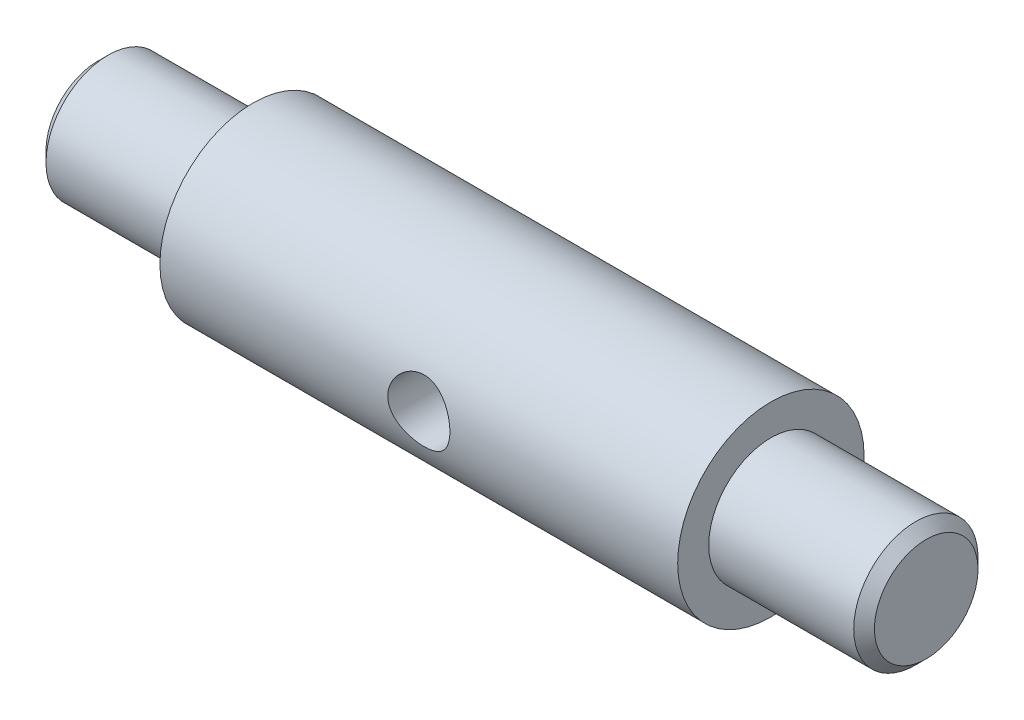
ISO-10303-21;
HEADER;
FILE_DESCRIPTION(('STEP AP214'),'2;1');
FILE_NAME('part.step','',(''),(''),'','','');
FILE_SCHEMA(('AUTOMOTIVE_DESIGN { 1 0 10303 214 1 1 1 1 }'));
ENDSEC;
DATA;
#1=APPLICATION_CONTEXT('core data for automotive mechanical design processes');
#2=APPLICATION_PROTOCOL_DEFINITION('international standard','automotive_design',2000,#1);
#3=PRODUCT_CONTEXT('',#1,'mechanical');
#4=PRODUCT('Part','Part','',(#3));
#5=PRODUCT_RELATED_PRODUCT_CATEGORY('part','',(#4));
#6=PRODUCT_DEFINITION_FORMATION('','',#4);
#7=PRODUCT_DEFINITION_CONTEXT('part definition',#1,'design');
#8=PRODUCT_DEFINITION('design','',#6,#7);
#9=PRODUCT_DEFINITION_SHAPE('','',#8);
#10=(LENGTH_UNIT() NAMED_UNIT(*) SI_UNIT(.MILLI.,.METRE.));
#11=(NAMED_UNIT(*) PLANE_ANGLE_UNIT() SI_UNIT($,.RADIAN.));
#12=(NAMED_UNIT(*) SI_UNIT($,.STERADIAN.) SOLID_ANGLE_UNIT());
#13=UNCERTAINTY_MEASURE_WITH_UNIT(LENGTH_MEASURE(1.E-05),#10,'distance_accuracy_value','');
#14=(GEOMETRIC_REPRESENTATION_CONTEXT(3) GLOBAL_UNCERTAINTY_ASSIGNED_CONTEXT((#13)) GLOBAL_UNIT_ASSIGNED_CONTEXT((#10,
#11,#12)) REPRESENTATION_CONTEXT('',''));
#15=CARTESIAN_POINT('',(0.,0.,0.));
#16=DIRECTION('',(0.,0.,1.));
#17=DIRECTION('',(1.,0.,0.));
#18=AXIS2_PLACEMENT_3D('',#15,#16,#17);
#19=CARTESIAN_POINT('',(40.,0.,-9.));
#20=DIRECTION('',(0.,0.,1.));
#21=DIRECTION('',(1.,0.,0.));
#22=AXIS2_PLACEMENT_3D('',#19,#20,#21);
#23=CYLINDRICAL_SURFACE('',#22,3.);
#24=CARTESIAN_POINT('',(43.,0.,9.));
#25=CARTESIAN_POINT('',(43.0000007611949,-0.16369008866017,9.00000045902832));
#26=CARTESIAN_POINT('',(42.9865592016184,-0.327375583615649,8.99549308522634));
#27=CARTESIAN_POINT('',(42.9333126735484,-0.649925282618916,8.97795630609842));
#28=CARTESIAN_POINT('',(42.8935049681532,-0.808788984356453,8.96492601606457));
#29=CARTESIAN_POINT('',(42.7890422698479,-1.11699836850533,8.93175923719328));
#30=CARTESIAN_POINT('',(42.7244288126222,-1.2663594776581,8.9116346319256));
#31=CARTESIAN_POINT('',(42.572376481485,-1.55212481041597,8.86633337152025));
#32=CARTESIAN_POINT('',(42.4849331049922,-1.68852647087612,8.84115572003333));
#33=CARTESIAN_POINT('',(42.2865225854237,-1.9492250250668,8.78742283329015));
#34=CARTESIAN_POINT('',(42.1749062972185,-2.07301110089493,8.75878669391354));
#35=CARTESIAN_POINT('',(41.9326985358803,-2.30049807810625,8.70180944349364));
#36=CARTESIAN_POINT('',(41.8021028952145,-2.40419455646839,8.67346839871647));
#37=CARTESIAN_POINT('',(41.5210446544106,-2.59147482668358,8.61939997431821));
#38=CARTESIAN_POINT('',(41.3701187808036,-2.67439457466309,8.59377117827064));
#39=CARTESIAN_POINT('',(41.0554717166244,-2.81345662163316,8.54925916255803));
#40=CARTESIAN_POINT('',(40.8917544485118,-2.8696070921603,8.53037388482237));
#41=CARTESIAN_POINT('',(40.5619803355099,-2.95162038452749,8.50233909808131));
#42=CARTESIAN_POINT('',(40.3961883745328,-2.97844034481531,8.49288287308833));
#43=CARTESIAN_POINT('',(40.0622087375324,-3.00402337000343,8.48386969888522));
#44=CARTESIAN_POINT('',(39.8940218178724,-3.00279510481416,8.4843096906819));
#45=CARTESIAN_POINT('',(39.5681901086679,-2.97305971111026,8.4947704502454));
#46=CARTESIAN_POINT('',(39.4104147912429,-2.94580173950099,8.50435247602598));
#47=CARTESIAN_POINT('',(39.1018197411795,-2.86681848854825,8.53129973173652));
#48=CARTESIAN_POINT('',(38.9510008436948,-2.81509027977562,8.54866589352322));
#49=CARTESIAN_POINT('',(38.6577617512256,-2.68781717418063,8.58953733393746));
#50=CARTESIAN_POINT('',(38.5155159235914,-2.61190214612179,8.61313697379352));
#51=CARTESIAN_POINT('',(38.2453872751608,-2.43866731890942,8.66377675727179));
#52=CARTESIAN_POINT('',(38.1175086191999,-2.34134133709202,8.6908178937139));
#53=CARTESIAN_POINT('',(37.8727252055177,-2.12204799804671,8.74701987503222));
#54=CARTESIAN_POINT('',(37.7567419164728,-1.99905945022894,8.77621768064528));
#55=CARTESIAN_POINT('',(37.5468062000098,-1.73501870991019,8.8322081516111));
#56=CARTESIAN_POINT('',(37.4528558855065,-1.59396478698244,8.85900058614202));
#57=CARTESIAN_POINT('',(37.2889110992948,-1.2958428391388,8.90751323813381));
#58=CARTESIAN_POINT('',(37.2191635259778,-1.13862982924901,8.92918050024118));
#59=CARTESIAN_POINT('',(37.1073904781329,-0.813807250093524,8.96461701433304));
#60=CARTESIAN_POINT('',(37.0653553737297,-0.646201314464864,8.97838900964638));
#61=CARTESIAN_POINT('',(37.0118330019329,-0.313151488587917,8.99602881214321));
#62=CARTESIAN_POINT('',(36.9991005724817,-0.147928799594543,9.00030005501184));
#63=CARTESIAN_POINT('',(37.0009980207954,0.182325209880709,8.99966708084482));
#64=CARTESIAN_POINT('',(37.0156232799396,0.347356557958949,8.99476441258087));
#65=CARTESIAN_POINT('',(37.0708357232079,0.667559598912765,8.97660074151313));
#66=CARTESIAN_POINT('',(37.1106586181485,0.822878420504528,8.96358596133577));
#67=CARTESIAN_POINT('',(37.2141803334002,1.12456787573872,8.9307554049021));
#68=CARTESIAN_POINT('',(37.2778821984034,1.27093736552582,8.91093876140025));
#69=CARTESIAN_POINT('',(37.4292112955224,1.55486488917982,8.86586793861869));
#70=CARTESIAN_POINT('',(37.5174237798495,1.69208987765144,8.84048444267358));
#71=CARTESIAN_POINT('',(37.7145824500404,1.95019449040676,8.78715761748787));
#72=CARTESIAN_POINT('',(37.8235349680953,2.07106910338673,8.75921350781482));
#73=CARTESIAN_POINT('',(38.0649362530198,2.2987575234189,8.70230543941334));
#74=CARTESIAN_POINT('',(38.1982276807806,2.40468290773731,8.67335283262283));
#75=CARTESIAN_POINT('',(38.4813147034327,2.59277256697072,8.61899919884126));
#76=CARTESIAN_POINT('',(38.6311104359022,2.67493664379304,8.59359820146007));
#77=CARTESIAN_POINT('',(38.9430190458697,2.81279079124909,8.5494717537415));
#78=CARTESIAN_POINT('',(39.1051062375063,2.86853439649506,8.53073282378936));
#79=CARTESIAN_POINT('',(39.4371359501324,2.95168400027807,8.50232496919348));
#80=CARTESIAN_POINT('',(39.607074896213,2.97910276486182,8.49265195870918));
#81=CARTESIAN_POINT('',(39.9405912881227,3.00382884743203,8.48393576622531));
#82=CARTESIAN_POINT('',(40.1040470208605,3.0026107719252,8.48437200772245));
#83=CARTESIAN_POINT('',(40.4282952247662,2.97372688034608,8.49453809471602));
#84=CARTESIAN_POINT('',(40.5890878538653,2.94606263837576,8.50426738708084));
#85=CARTESIAN_POINT('',(40.9004069890074,2.86611543938804,8.53153572914675));
#86=CARTESIAN_POINT('',(41.0510704750135,2.81431003804654,8.54892294067432));
#87=CARTESIAN_POINT('',(41.3416822208148,2.68793809727924,8.58949196455405));
#88=CARTESIAN_POINT('',(41.481628093564,2.61336650566142,8.61267506290179));
#89=CARTESIAN_POINT('',(41.7534510097687,2.43978207775029,8.66348487678139));
#90=CARTESIAN_POINT('',(41.8847095056952,2.33984472829374,8.69126134926411));
#91=CARTESIAN_POINT('',(42.1290694401526,2.11992864940694,8.74750068849758));
#92=CARTESIAN_POINT('',(42.2421657270642,1.99994425335444,8.77596374737117));
#93=CARTESIAN_POINT('',(42.4514332368675,1.73772467076207,8.83170091576632));
#94=CARTESIAN_POINT('',(42.546773043253,1.59480454049919,8.8588854540377));
#95=CARTESIAN_POINT('',(42.7119712865519,1.29407207221988,8.90777973517836));
#96=CARTESIAN_POINT('',(42.7818362377661,1.13626355439705,8.92949087723789));
#97=CARTESIAN_POINT('',(42.891164897466,0.81748094160293,8.96416545205625));
#98=CARTESIAN_POINT('',(42.9318473987901,0.656963273029229,8.97747637267567));
#99=CARTESIAN_POINT('',(42.9862608420314,0.330961248030743,8.99539221192665));
#100=CARTESIAN_POINT('',(42.9999992304896,0.16547827670624,8.99999953595715));
#101=CARTESIAN_POINT('',(43.,0.,9.));
#102=B_SPLINE_CURVE_WITH_KNOTS('',3,(#24,#25,#26,#27,#28,#29,#30,#31,#32,#33,#34,#35,#36,#37,
#38,#39,#40,#41,#42,#43,#44,#45,#46,#47,#48,#49,#50,#51,#52,#53,#54,#55,#56,#57,#58,#59,#60,#61,
#62,#63,#64,#65,#66,#67,#68,#69,#70,#71,#72,#73,#74,#75,#76,#77,#78,#79,#80,#81,#82,#83,#84,#85,
#86,#87,#88,#89,#90,#91,#92,#93,#94,#95,#96,#97,#98,#99,#100,#101),.UNSPECIFIED.,.T.,.F.,(4,2,2,
2,2,2,2,2,2,2,2,2,2,2,2,2,2,2,2,2,2,2,2,2,2,2,2,2,2,2,2,2,2,2,2,2,2,2,4),(0.,0.490461318078033,
0.980973555802562,1.47066801861082,1.9604591333973,2.46554052848268,2.97073299862591,
3.49045154470411,4.010011340785,4.51205777225521,5.01394901962457,5.49290479653841,
5.97191792566446,6.45864513465392,6.94551307674622,7.45779917434101,7.97013437899855,
8.48755216951073,9.00479006631625,9.49960749525509,9.9943413949253,10.4747447393464,
10.9552093585231,11.4483119953121,11.9415654246567,12.4572306864226,12.9729002470499,
13.4875204148031,14.0019085411752,14.4898699819277,14.9778023805413,15.4564676124125,
15.9352391452793,16.4349020007541,16.9347063337134,17.453989825053,17.9731404345737,
18.4690967512144,18.9649159811442),.UNSPECIFIED.);
#103=CARTESIAN_POINT('',(43.,0.,9.));
#104=VERTEX_POINT('',#103);
#105=EDGE_CURVE('E96',#104,#104,#102,.T.);
#106=ORIENTED_EDGE('',*,*,#105,.F.);
#107=EDGE_LOOP('',(#106));
#108=FACE_BOUND('',#107,.T.);
#109=CARTESIAN_POINT('',(40.,0.,0.));
#110=DIRECTION('',(0.707106781186547,0.,0.707106781186547));
#111=DIRECTION('',(-0.707106781186547,0.,0.707106781186547));
#112=AXIS2_PLACEMENT_3D('',#109,#110,#111);
#113=ELLIPSE('',#112,4.24264068711928,3.);
#114=CARTESIAN_POINT('',(40.,-3.,0.));
#115=VERTEX_POINT('',#114);
#116=CARTESIAN_POINT('',(40.,3.,0.));
#117=VERTEX_POINT('',#116);
#118=EDGE_CURVE('E53',#115,#117,#113,.F.);
#119=ORIENTED_EDGE('',*,*,#118,.T.);
#120=CARTESIAN_POINT('',(40.,0.,0.));
#121=DIRECTION('',(-0.707106781186547,0.,0.707106781186547));
#122=DIRECTION('',(0.707106781186547,0.,0.707106781186547));
#123=AXIS2_PLACEMENT_3D('',#120,#121,#122);
#124=ELLIPSE('',#123,4.24264068711928,3.);
#125=EDGE_CURVE('E11',#117,#115,#124,.F.);
#126=ORIENTED_EDGE('',*,*,#125,.T.);
#127=EDGE_LOOP('',(#119,#126));
#128=FACE_BOUND('',#127,.T.);
#129=ADVANCED_FACE('F39',(#108,#128),#23,.F.);
#130=CARTESIAN_POINT('',(0.,5.99999999999999,0.));
#131=DIRECTION('',(1.,0.,0.));
#132=DIRECTION('',(0.,0.,-1.));
#133=AXIS2_PLACEMENT_3D('',#130,#131,#132);
#134=PLANE('',#133);
#135=CARTESIAN_POINT('',(0.,0.,0.));
#136=DIRECTION('',(-1.,0.,0.));
#137=DIRECTION('',(0.,0.,1.));
#138=AXIS2_PLACEMENT_3D('',#135,#136,#137);
#139=CIRCLE('',#138,3.);
#140=CARTESIAN_POINT('',(0.,0.,3.));
#141=VERTEX_POINT('',#140);
#142=EDGE_CURVE('E75',#141,#141,#139,.T.);
#143=ORIENTED_EDGE('',*,*,#142,.F.);
#144=EDGE_LOOP('',(#143));
#145=FACE_BOUND('',#144,.T.);
#146=CARTESIAN_POINT('',(0.,0.,0.));
#147=DIRECTION('',(1.,0.,0.));
#148=DIRECTION('',(0.,0.,-1.));
#149=AXIS2_PLACEMENT_3D('',#146,#147,#148);
#150=CIRCLE('',#149,4.99999999999998);
#151=CARTESIAN_POINT('',(0.,0.,-4.99999999999998));
#152=VERTEX_POINT('',#151);
#153=EDGE_CURVE('E178',#152,#152,#150,.F.);
#154=ORIENTED_EDGE('',*,*,#153,.T.);
#155=EDGE_LOOP('',(#154));
#156=FACE_BOUND('',#155,.T.);
#157=ADVANCED_FACE('F136',(#145,#156),#134,.F.);
#158=CARTESIAN_POINT('',(80.,0.,0.));
#159=DIRECTION('',(-1.,0.,0.));
#160=DIRECTION('',(0.,0.,1.));
#161=AXIS2_PLACEMENT_3D('',#158,#159,#160);
#162=PLANE('',#161);
#163=CARTESIAN_POINT('',(80.,0.,0.));
#164=DIRECTION('',(-1.,0.,0.));
#165=DIRECTION('',(0.,0.,1.));
#166=AXIS2_PLACEMENT_3D('',#163,#164,#165);
#167=CIRCLE('',#166,5.00000000000002);
#168=CARTESIAN_POINT('',(80.,0.,5.00000000000002));
#169=VERTEX_POINT('',#168);
#170=EDGE_CURVE('E189',#169,#169,#167,.F.);
#171=ORIENTED_EDGE('',*,*,#170,.T.);
#172=EDGE_LOOP('',(#171));
#173=FACE_BOUND('',#172,.T.);
#174=ADVANCED_FACE('F141',(#173),#162,.F.);
#175=CARTESIAN_POINT('',(0.,0.,0.));
#176=DIRECTION('',(-1.,0.,0.));
#177=DIRECTION('',(0.,0.,1.));
#178=AXIS2_PLACEMENT_3D('',#175,#176,#177);
#179=CYLINDRICAL_SURFACE('',#178,6.);
#180=CARTESIAN_POINT('',(79.,0.,0.));
#181=DIRECTION('',(-1.,0.,0.));
#182=DIRECTION('',(0.,0.,1.));
#183=AXIS2_PLACEMENT_3D('',#180,#181,#182);
#184=CIRCLE('',#183,6.);
#185=CARTESIAN_POINT('',(79.,0.,6.));
#186=VERTEX_POINT('',#185);
#187=EDGE_CURVE('E183',#186,#186,#184,.T.);
#188=ORIENTED_EDGE('',*,*,#187,.T.);
#189=EDGE_LOOP('',(#188));
#190=FACE_BOUND('',#189,.T.);
#191=CARTESIAN_POINT('',(65.,0.,0.));
#192=DIRECTION('',(-1.,0.,0.));
#193=DIRECTION('',(0.,0.,1.));
#194=AXIS2_PLACEMENT_3D('',#191,#192,#193);
#195=CIRCLE('',#194,6.);
#196=CARTESIAN_POINT('',(65.,0.,6.));
#197=VERTEX_POINT('',#196);
#198=EDGE_CURVE('E92',#197,#197,#195,.T.);
#199=ORIENTED_EDGE('',*,*,#198,.F.);
#200=EDGE_LOOP('',(#199));
#201=FACE_BOUND('',#200,.T.);
#202=ADVANCED_FACE('F153',(#190,#201),#179,.T.);
#203=CARTESIAN_POINT('',(65.,6.,0.));
#204=DIRECTION('',(-1.,0.,0.));
#205=DIRECTION('',(0.,0.,1.));
#206=AXIS2_PLACEMENT_3D('',#203,#204,#205);
#207=PLANE('',#206);
#208=CARTESIAN_POINT('',(65.,0.,0.));
#209=DIRECTION('',(-1.,0.,0.));
#210=DIRECTION('',(0.,0.,1.));
#211=AXIS2_PLACEMENT_3D('',#208,#209,#210);
#212=CIRCLE('',#211,9.);
#213=CARTESIAN_POINT('',(65.,0.,9.));
#214=VERTEX_POINT('',#213);
#215=EDGE_CURVE('E88',#214,#214,#212,.T.);
#216=ORIENTED_EDGE('',*,*,#215,.F.);
#217=EDGE_LOOP('',(#216));
#218=FACE_BOUND('',#217,.T.);
#219=ORIENTED_EDGE('',*,*,#198,.T.);
#220=EDGE_LOOP('',(#219));
#221=FACE_BOUND('',#220,.T.);
#222=ADVANCED_FACE('F131',(#218,#221),#207,.F.);
#223=CARTESIAN_POINT('',(0.,0.,0.));
#224=DIRECTION('',(-1.,0.,0.));
#225=DIRECTION('',(0.,0.,1.));
#226=AXIS2_PLACEMENT_3D('',#223,#224,#225);
#227=CYLINDRICAL_SURFACE('',#226,9.);
#228=CARTESIAN_POINT('',(43.,0.,-9.));
#229=CARTESIAN_POINT('',(43.0000007611949,0.16369008866017,-9.00000045902832));
#230=CARTESIAN_POINT('',(42.9865592016184,0.32737558361565,-8.99549308522634));
#231=CARTESIAN_POINT('',(42.9333126735484,0.649925282618917,-8.97795630609842));
#232=CARTESIAN_POINT('',(42.8935049681532,0.808788984356453,-8.96492601606457));
#233=CARTESIAN_POINT('',(42.7890422698479,1.11699836850533,-8.93175923719328));
#234=CARTESIAN_POINT('',(42.7244288126222,1.2663594776581,-8.9116346319256));
#235=CARTESIAN_POINT('',(42.572376481485,1.55212481041597,-8.86633337152025));
#236=CARTESIAN_POINT('',(42.4849331049922,1.68852647087612,-8.84115572003334));
#237=CARTESIAN_POINT('',(42.2865225854237,1.9492250250668,-8.78742283329015));
#238=CARTESIAN_POINT('',(42.1749062972185,2.07301110089493,-8.75878669391354));
#239=CARTESIAN_POINT('',(41.9326985358803,2.30049807810625,-8.70180944349364));
#240=CARTESIAN_POINT('',(41.8021028952145,2.40419455646839,-8.67346839871647));
#241=CARTESIAN_POINT('',(41.5210446544106,2.59147482668358,-8.61939997431821));
#242=CARTESIAN_POINT('',(41.3701187808036,2.67439457466309,-8.59377117827064));
#243=CARTESIAN_POINT('',(41.0554717166244,2.81345662163316,-8.54925916255803));
#244=CARTESIAN_POINT('',(40.8917544485118,2.8696070921603,-8.53037388482237));
#245=CARTESIAN_POINT('',(40.5619803355099,2.95162038452749,-8.50233909808131));
#246=CARTESIAN_POINT('',(40.3961883745328,2.97844034481531,-8.49288287308833));
#247=CARTESIAN_POINT('',(40.0622087375324,3.00402337000343,-8.48386969888522));
#248=CARTESIAN_POINT('',(39.8940218178724,3.00279510481416,-8.4843096906819));
#249=CARTESIAN_POINT('',(39.5681901086679,2.97305971111026,-8.4947704502454));
#250=CARTESIAN_POINT('',(39.4104147912429,2.94580173950099,-8.50435247602598));
#251=CARTESIAN_POINT('',(39.1018197411795,2.86681848854825,-8.53129973173652));
#252=CARTESIAN_POINT('',(38.9510008436948,2.81509027977562,-8.54866589352322));
#253=CARTESIAN_POINT('',(38.6577617512256,2.68781717418063,-8.58953733393746));
#254=CARTESIAN_POINT('',(38.5155159235914,2.61190214612179,-8.61313697379352));
#255=CARTESIAN_POINT('',(38.2453872751608,2.43866731890942,-8.66377675727179));
#256=CARTESIAN_POINT('',(38.1175086191999,2.34134133709202,-8.6908178937139));
#257=CARTESIAN_POINT('',(37.8727252055177,2.12204799804671,-8.74701987503222));
#258=CARTESIAN_POINT('',(37.7567419164728,1.99905945022894,-8.77621768064528));
#259=CARTESIAN_POINT('',(37.5468062000098,1.73501870991019,-8.8322081516111));
#260=CARTESIAN_POINT('',(37.4528558855065,1.59396478698244,-8.85900058614202));
#261=CARTESIAN_POINT('',(37.2889110992948,1.2958428391388,-8.90751323813381));
#262=CARTESIAN_POINT('',(37.2191635259778,1.13862982924901,-8.92918050024118));
#263=CARTESIAN_POINT('',(37.1073904781329,0.813807250093523,-8.96461701433304));
#264=CARTESIAN_POINT('',(37.0653553737297,0.646201314464864,-8.97838900964638));
#265=CARTESIAN_POINT('',(37.0118330019329,0.313151488587917,-8.99602881214321));
#266=CARTESIAN_POINT('',(36.9991005724817,0.147928799594542,-9.00030005501184));
#267=CARTESIAN_POINT('',(37.0009980207954,-0.18232520988071,-8.99966708084482));
#268=CARTESIAN_POINT('',(37.0156232799396,-0.34735655795895,-8.99476441258087));
#269=CARTESIAN_POINT('',(37.0708357232079,-0.667559598912765,-8.97660074151313));
#270=CARTESIAN_POINT('',(37.1106586181485,-0.822878420504528,-8.96358596133577));
#271=CARTESIAN_POINT('',(37.2141803334002,-1.12456787573872,-8.9307554049021));
#272=CARTESIAN_POINT('',(37.2778821984034,-1.27093736552582,-8.91093876140025));
#273=CARTESIAN_POINT('',(37.4292112955224,-1.55486488917982,-8.86586793861869));
#274=CARTESIAN_POINT('',(37.5174237798495,-1.69208987765144,-8.84048444267358));
#275=CARTESIAN_POINT('',(37.7145824500404,-1.95019449040676,-8.78715761748787));
#276=CARTESIAN_POINT('',(37.8235349680953,-2.07106910338673,-8.75921350781482));
#277=CARTESIAN_POINT('',(38.0649362530198,-2.2987575234189,-8.70230543941334));
#278=CARTESIAN_POINT('',(38.1982276807806,-2.40468290773731,-8.67335283262283));
#279=CARTESIAN_POINT('',(38.4813147034327,-2.59277256697072,-8.61899919884126));
#280=CARTESIAN_POINT('',(38.6311104359022,-2.67493664379304,-8.59359820146007));
#281=CARTESIAN_POINT('',(38.9430190458697,-2.81279079124909,-8.5494717537415));
#282=CARTESIAN_POINT('',(39.1051062375063,-2.86853439649506,-8.53073282378936));
#283=CARTESIAN_POINT('',(39.4371359501324,-2.95168400027807,-8.50232496919348));
#284=CARTESIAN_POINT('',(39.607074896213,-2.97910276486182,-8.49265195870918));
#285=CARTESIAN_POINT('',(39.9405912881227,-3.00382884743203,-8.48393576622531));
#286=CARTESIAN_POINT('',(40.1040470208605,-3.0026107719252,-8.48437200772245));
#287=CARTESIAN_POINT('',(40.4282952247662,-2.97372688034608,-8.49453809471602));
#288=CARTESIAN_POINT('',(40.5890878538653,-2.94606263837576,-8.50426738708084));
#289=CARTESIAN_POINT('',(40.9004069890074,-2.86611543938804,-8.53153572914675));
#290=CARTESIAN_POINT('',(41.0510704750135,-2.81431003804654,-8.54892294067432));
#291=CARTESIAN_POINT('',(41.3416822208148,-2.68793809727924,-8.58949196455405));
#292=CARTESIAN_POINT('',(41.481628093564,-2.61336650566142,-8.61267506290179));
#293=CARTESIAN_POINT('',(41.7534510097687,-2.43978207775029,-8.66348487678139));
#294=CARTESIAN_POINT('',(41.8847095056952,-2.33984472829374,-8.69126134926411));
#295=CARTESIAN_POINT('',(42.1290694401526,-2.11992864940694,-8.74750068849758));
#296=CARTESIAN_POINT('',(42.2421657270642,-1.99994425335444,-8.77596374737117));
#297=CARTESIAN_POINT('',(42.4514332368675,-1.73772467076207,-8.83170091576632));
#298=CARTESIAN_POINT('',(42.546773043253,-1.59480454049919,-8.8588854540377));
#299=CARTESIAN_POINT('',(42.7119712865519,-1.29407207221988,-8.90777973517836));
#300=CARTESIAN_POINT('',(42.7818362377661,-1.13626355439705,-8.92949087723789));
#301=CARTESIAN_POINT('',(42.891164897466,-0.81748094160293,-8.96416545205625));
#302=CARTESIAN_POINT('',(42.9318473987901,-0.656963273029229,-8.97747637267568));
#303=CARTESIAN_POINT('',(42.9862608420314,-0.330961248030743,-8.99539221192665));
#304=CARTESIAN_POINT('',(42.9999992304896,-0.16547827670624,-8.99999953595714));
#305=CARTESIAN_POINT('',(43.,0.,-9.));
#306=B_SPLINE_CURVE_WITH_KNOTS('',3,(#228,#229,#230,#231,#232,#233,#234,#235,#236,#237,#238,
#239,#240,#241,#242,#243,#244,#245,#246,#247,#248,#249,#250,#251,#252,#253,#254,#255,#256,#257,
#258,#259,#260,#261,#262,#263,#264,#265,#266,#267,#268,#269,#270,#271,#272,#273,#274,#275,#276,
#277,#278,#279,#280,#281,#282,#283,#284,#285,#286,#287,#288,#289,#290,#291,#292,#293,#294,#295,
#296,#297,#298,#299,#300,#301,#302,#303,#304,#305),.UNSPECIFIED.,.T.,.F.,(4,2,2,2,2,2,2,2,2,2,2,
2,2,2,2,2,2,2,2,2,2,2,2,2,2,2,2,2,2,2,2,2,2,2,2,2,2,2,4),(0.,0.490461318078033,
0.980973555802562,1.47066801861082,1.9604591333973,2.46554052848268,2.97073299862591,
3.49045154470411,4.010011340785,4.51205777225521,5.01394901962457,5.49290479653841,
5.97191792566446,6.45864513465392,6.94551307674622,7.45779917434101,7.97013437899855,
8.48755216951073,9.00479006631625,9.49960749525509,9.9943413949253,10.4747447393464,
10.9552093585231,11.4483119953121,11.9415654246567,12.4572306864226,12.9729002470499,
13.4875204148031,14.0019085411752,14.4898699819278,14.9778023805413,15.4564676124125,
15.9352391452793,16.4349020007542,16.9347063337134,17.453989825053,17.9731404345737,
18.4690967512144,18.9649159811442),.UNSPECIFIED.);
#307=CARTESIAN_POINT('',(43.,0.,-9.));
#308=VERTEX_POINT('',#307);
#309=EDGE_CURVE('E105',#308,#308,#306,.T.);
#310=ORIENTED_EDGE('',*,*,#309,.T.);
#311=EDGE_LOOP('',(#310));
#312=FACE_BOUND('',#311,.T.);
#313=ORIENTED_EDGE('',*,*,#105,.T.);
#314=EDGE_LOOP('',(#313));
#315=FACE_BOUND('',#314,.T.);
#316=CARTESIAN_POINT('',(15.,0.,0.));
#317=DIRECTION('',(-1.,0.,0.));
#318=DIRECTION('',(0.,0.,1.));
#319=AXIS2_PLACEMENT_3D('',#316,#317,#318);
#320=CIRCLE('',#319,8.99999999999999);
#321=CARTESIAN_POINT('',(15.,0.,8.99999999999999));
#322=VERTEX_POINT('',#321);
#323=EDGE_CURVE('E80',#322,#322,#320,.T.);
#324=ORIENTED_EDGE('',*,*,#323,.F.);
#325=EDGE_LOOP('',(#324));
#326=FACE_BOUND('',#325,.T.);
#327=ORIENTED_EDGE('',*,*,#215,.T.);
#328=EDGE_LOOP('',(#327));
#329=FACE_BOUND('',#328,.T.);
#330=ADVANCED_FACE('F110',(#312,#315,#326,#329),#227,.T.);
#331=CARTESIAN_POINT('',(15.,8.99999999999999,0.));
#332=DIRECTION('',(1.,0.,0.));
#333=DIRECTION('',(0.,0.,-1.));
#334=AXIS2_PLACEMENT_3D('',#331,#332,#333);
#335=PLANE('',#334);
#336=CARTESIAN_POINT('',(15.,0.,0.));
#337=DIRECTION('',(-1.,0.,0.));
#338=DIRECTION('',(0.,0.,1.));
#339=AXIS2_PLACEMENT_3D('',#336,#337,#338);
#340=CIRCLE('',#339,5.99999999999999);
#341=CARTESIAN_POINT('',(15.,0.,5.99999999999999));
#342=VERTEX_POINT('',#341);
#343=EDGE_CURVE('E74',#342,#342,#340,.T.);
#344=ORIENTED_EDGE('',*,*,#343,.F.);
#345=EDGE_LOOP('',(#344));
#346=FACE_BOUND('',#345,.T.);
#347=ORIENTED_EDGE('',*,*,#323,.T.);
#348=EDGE_LOOP('',(#347));
#349=FACE_BOUND('',#348,.T.);
#350=ADVANCED_FACE('F124',(#346,#349),#335,.F.);
#351=CARTESIAN_POINT('',(0.,0.,0.));
#352=DIRECTION('',(-1.,0.,0.));
#353=DIRECTION('',(0.,0.,1.));
#354=AXIS2_PLACEMENT_3D('',#351,#352,#353);
#355=CYLINDRICAL_SURFACE('',#354,5.99999999999999);
#356=CARTESIAN_POINT('',(1.00000000000001,0.,0.));
#357=DIRECTION('',(1.,0.,0.));
#358=DIRECTION('',(0.,0.,-1.));
#359=AXIS2_PLACEMENT_3D('',#356,#357,#358);
#360=CIRCLE('',#359,5.99999999999999);
#361=CARTESIAN_POINT('',(1.00000000000001,0.,-5.99999999999999));
#362=VERTEX_POINT('',#361);
#363=EDGE_CURVE('E175',#362,#362,#360,.T.);
#364=ORIENTED_EDGE('',*,*,#363,.T.);
#365=EDGE_LOOP('',(#364));
#366=FACE_BOUND('',#365,.T.);
#367=ORIENTED_EDGE('',*,*,#343,.T.);
#368=EDGE_LOOP('',(#367));
#369=FACE_BOUND('',#368,.T.);
#370=ADVANCED_FACE('F119',(#366,#369),#355,.T.);
#371=CARTESIAN_POINT('',(40.,0.,0.));
#372=DIRECTION('',(0.707106781186547,0.,0.707106781186547));
#373=DIRECTION('',(-0.707106781186547,0.,0.707106781186547));
#374=AXIS2_PLACEMENT_3D('',#371,#372,#373);
#375=ELLIPSE('',#374,4.24264068711928,3.);
#376=EDGE_CURVE('E60',#115,#117,#375,.T.);
#377=ORIENTED_EDGE('',*,*,#376,.T.);
#378=CARTESIAN_POINT('',(40.,0.,0.));
#379=DIRECTION('',(-0.707106781186547,0.,0.707106781186547));
#380=DIRECTION('',(0.707106781186547,0.,0.707106781186547));
#381=AXIS2_PLACEMENT_3D('',#378,#379,#380);
#382=ELLIPSE('',#381,4.24264068711928,3.);
#383=EDGE_CURVE('E48',#117,#115,#382,.T.);
#384=ORIENTED_EDGE('',*,*,#383,.T.);
#385=EDGE_LOOP('',(#377,#384));
#386=FACE_BOUND('',#385,.T.);
#387=ORIENTED_EDGE('',*,*,#309,.F.);
#388=EDGE_LOOP('',(#387));
#389=FACE_BOUND('',#388,.T.);
#390=ADVANCED_FACE('F114',(#386,#389),#23,.F.);
#391=CARTESIAN_POINT('',(0.,0.,0.));
#392=DIRECTION('',(1.,0.,0.));
#393=DIRECTION('',(0.,0.,-1.));
#394=AXIS2_PLACEMENT_3D('',#391,#392,#393);
#395=CONICAL_SURFACE('',#394,4.99999999999998,0.785398163397448);
#396=ORIENTED_EDGE('',*,*,#363,.F.);
#397=EDGE_LOOP('',(#396));
#398=FACE_BOUND('',#397,.T.);
#399=ORIENTED_EDGE('',*,*,#153,.F.);
#400=EDGE_LOOP('',(#399));
#401=FACE_BOUND('',#400,.T.);
#402=ADVANCED_FACE('F118',(#398,#401),#395,.T.);
#403=CARTESIAN_POINT('',(79.,0.,0.));
#404=DIRECTION('',(-1.,0.,0.));
#405=DIRECTION('',(0.,0.,1.));
#406=AXIS2_PLACEMENT_3D('',#403,#404,#405);
#407=CONICAL_SURFACE('',#406,6.,0.785398163397449);
#408=ORIENTED_EDGE('',*,*,#170,.F.);
#409=EDGE_LOOP('',(#408));
#410=FACE_BOUND('',#409,.T.);
#411=ORIENTED_EDGE('',*,*,#187,.F.);
#412=EDGE_LOOP('',(#411));
#413=FACE_BOUND('',#412,.T.);
#414=ADVANCED_FACE('F41',(#410,#413),#407,.T.);
#415=CARTESIAN_POINT('',(0.,0.,0.));
#416=DIRECTION('',(-1.,0.,0.));
#417=DIRECTION('',(0.,0.,1.));
#418=AXIS2_PLACEMENT_3D('',#415,#416,#417);
#419=CYLINDRICAL_SURFACE('',#418,3.);
#420=ORIENTED_EDGE('',*,*,#142,.T.);
#421=EDGE_LOOP('',(#420));
#422=FACE_BOUND('',#421,.T.);
#423=ORIENTED_EDGE('',*,*,#118,.F.);
#424=ORIENTED_EDGE('',*,*,#383,.F.);
#425=EDGE_LOOP('',(#423,#424));
#426=FACE_BOUND('',#425,.T.);
#427=ADVANCED_FACE('F170',(#422,#426),#419,.F.);
#428=CARTESIAN_POINT('',(45.,0.,0.));
#429=DIRECTION('',(-1.,0.,0.));
#430=DIRECTION('',(0.,0.,1.));
#431=AXIS2_PLACEMENT_3D('',#428,#429,#430);
#432=CIRCLE('',#431,2.99999999999999);
#433=CARTESIAN_POINT('',(45.,0.,2.99999999999999));
#434=VERTEX_POINT('',#433);
#435=EDGE_CURVE('E71',#434,#434,#432,.T.);
#436=ORIENTED_EDGE('',*,*,#435,.F.);
#437=EDGE_LOOP('',(#436));
#438=FACE_BOUND('',#437,.T.);
#439=ORIENTED_EDGE('',*,*,#376,.F.);
#440=ORIENTED_EDGE('',*,*,#125,.F.);
#441=EDGE_LOOP('',(#439,#440));
#442=FACE_BOUND('',#441,.T.);
#443=ADVANCED_FACE('F67',(#438,#442),#419,.F.);
#444=CARTESIAN_POINT('',(45.,0.,0.));
#445=DIRECTION('',(-1.,0.,0.));
#446=DIRECTION('',(0.,0.,1.));
#447=AXIS2_PLACEMENT_3D('',#444,#445,#446);
#448=CONICAL_SURFACE('',#447,2.99999999999999,1.02974425867665);
#449=CARTESIAN_POINT('',(46.8025818570827,0.,0.));
#450=VERTEX_POINT('',#449);
#451=VERTEX_LOOP('',#450);
#452=FACE_BOUND('',#451,.T.);
#453=ORIENTED_EDGE('',*,*,#435,.T.);
#454=EDGE_LOOP('',(#453));
#455=FACE_BOUND('',#454,.T.);
#456=ADVANCED_FACE('F64',(#452,#455),#448,.F.);
#457=CLOSED_SHELL('',(#129,#157,#174,#202,#222,#330,#350,#370,#390,#402,#414,#427,#443,#456));
#458=MANIFOLD_SOLID_BREP('B2',#457);
#459=ADVANCED_BREP_SHAPE_REPRESENTATION('',(#18,#458),#14);
#460=SHAPE_DEFINITION_REPRESENTATION(#9,#459);
ENDSEC;
END-ISO-10303-21;
